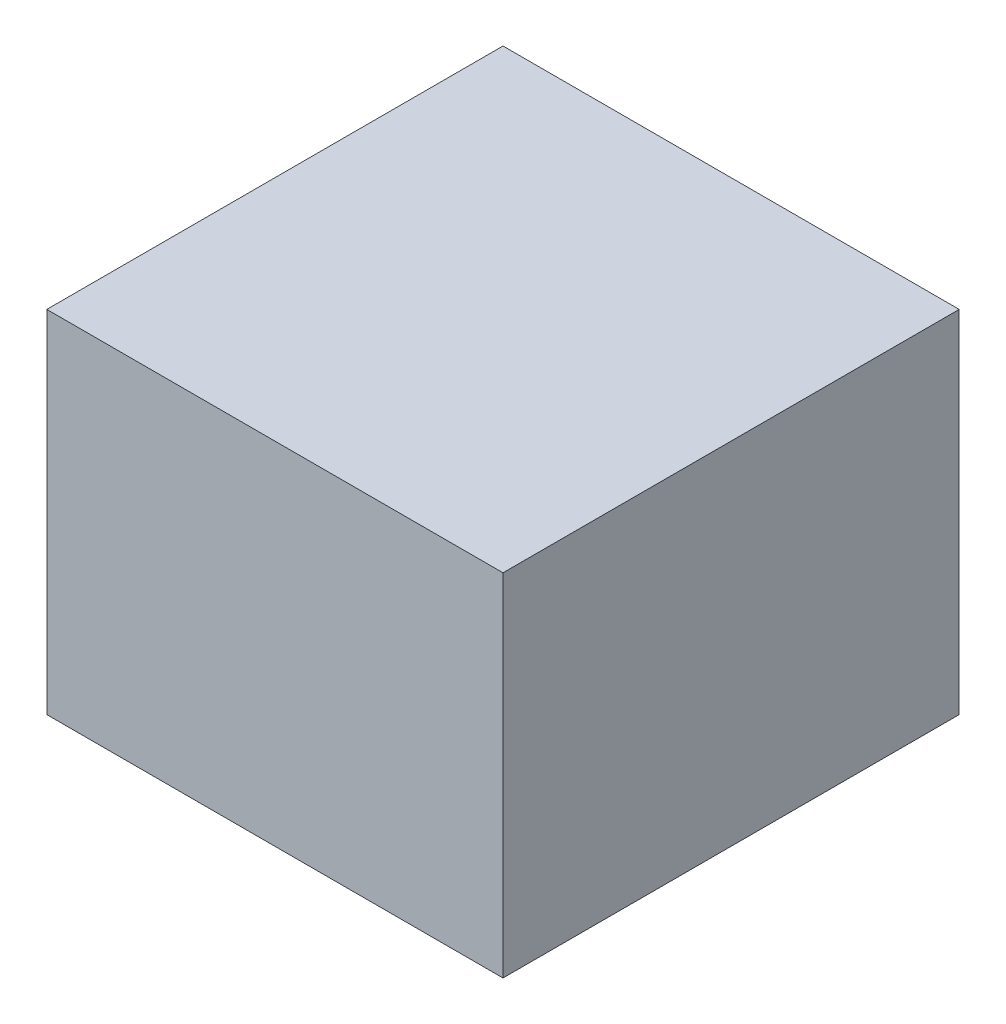
ISO-10303-21;
HEADER;
FILE_DESCRIPTION(('STEP AP214'),'2;1');
FILE_NAME('part.step','',(''),(''),'','','');
FILE_SCHEMA(('AUTOMOTIVE_DESIGN { 1 0 10303 214 1 1 1 1 }'));
ENDSEC;
DATA;
#1=APPLICATION_CONTEXT('core data for automotive mechanical design processes');
#2=APPLICATION_PROTOCOL_DEFINITION('international standard','automotive_design',2000,#1);
#3=PRODUCT_CONTEXT('',#1,'mechanical');
#4=PRODUCT('Part','Part','',(#3));
#5=PRODUCT_RELATED_PRODUCT_CATEGORY('part','',(#4));
#6=PRODUCT_DEFINITION_FORMATION('','',#4);
#7=PRODUCT_DEFINITION_CONTEXT('part definition',#1,'design');
#8=PRODUCT_DEFINITION('design','',#6,#7);
#9=PRODUCT_DEFINITION_SHAPE('','',#8);
#10=(LENGTH_UNIT() NAMED_UNIT(*) SI_UNIT(.MILLI.,.METRE.));
#11=(NAMED_UNIT(*) PLANE_ANGLE_UNIT() SI_UNIT($,.RADIAN.));
#12=(NAMED_UNIT(*) SI_UNIT($,.STERADIAN.) SOLID_ANGLE_UNIT());
#13=UNCERTAINTY_MEASURE_WITH_UNIT(LENGTH_MEASURE(1.E-05),#10,'distance_accuracy_value','');
#14=(GEOMETRIC_REPRESENTATION_CONTEXT(3) GLOBAL_UNCERTAINTY_ASSIGNED_CONTEXT((#13)) GLOBAL_UNIT_ASSIGNED_CONTEXT((#10,
#11,#12)) REPRESENTATION_CONTEXT('',''));
#15=CARTESIAN_POINT('',(0.,0.,0.));
#16=DIRECTION('',(0.,0.,1.));
#17=DIRECTION('',(1.,0.,0.));
#18=AXIS2_PLACEMENT_3D('',#15,#16,#17);
#19=CARTESIAN_POINT('',(22.5,7.5,-22.5));
#20=DIRECTION('',(-1.,0.,0.));
#21=DIRECTION('',(0.,0.,1.));
#22=AXIS2_PLACEMENT_3D('',#19,#20,#21);
#23=PLANE('',#22);
#24=DIRECTION('',(0.,0.,-1.));
#25=VECTOR('',#24,1.);
#26=CARTESIAN_POINT('',(22.5,0.,-22.5));
#27=LINE('',#26,#25);
#28=CARTESIAN_POINT('',(22.5,0.,22.5));
#29=VERTEX_POINT('',#28);
#30=CARTESIAN_POINT('',(22.5,0.,-22.5));
#31=VERTEX_POINT('',#30);
#32=EDGE_CURVE('E141',#29,#31,#27,.T.);
#33=ORIENTED_EDGE('',*,*,#32,.T.);
#34=DIRECTION('',(0.,-1.,0.));
#35=VECTOR('',#34,1.);
#36=CARTESIAN_POINT('',(22.5,7.5,-22.5));
#37=LINE('',#36,#35);
#38=CARTESIAN_POINT('',(22.5,7.5,-22.5));
#39=VERTEX_POINT('',#38);
#40=EDGE_CURVE('E11',#39,#31,#37,.T.);
#41=ORIENTED_EDGE('',*,*,#40,.F.);
#42=DIRECTION('',(0.,0.,-1.));
#43=VECTOR('',#42,1.);
#44=CARTESIAN_POINT('',(22.5,7.5,-22.5));
#45=LINE('',#44,#43);
#46=CARTESIAN_POINT('',(22.5,7.5,22.5));
#47=VERTEX_POINT('',#46);
#48=EDGE_CURVE('E152',#47,#39,#45,.T.);
#49=ORIENTED_EDGE('',*,*,#48,.F.);
#50=DIRECTION('',(0.,-1.,0.));
#51=VECTOR('',#50,1.);
#52=CARTESIAN_POINT('',(22.5,7.5,22.5));
#53=LINE('',#52,#51);
#54=EDGE_CURVE('E165',#47,#29,#53,.T.);
#55=ORIENTED_EDGE('',*,*,#54,.T.);
#56=EDGE_LOOP('',(#33,#41,#49,#55));
#57=FACE_BOUND('',#56,.T.);
#58=ADVANCED_FACE('F39',(#57),#23,.F.);
#59=CARTESIAN_POINT('',(-22.5,7.5,-22.5));
#60=DIRECTION('',(0.,0.,1.));
#61=DIRECTION('',(1.,0.,0.));
#62=AXIS2_PLACEMENT_3D('',#59,#60,#61);
#63=PLANE('',#62);
#64=DIRECTION('',(-1.,0.,0.));
#65=VECTOR('',#64,1.);
#66=CARTESIAN_POINT('',(-22.5,0.,-22.5));
#67=LINE('',#66,#65);
#68=CARTESIAN_POINT('',(-22.5,0.,-22.5));
#69=VERTEX_POINT('',#68);
#70=EDGE_CURVE('E146',#31,#69,#67,.T.);
#71=ORIENTED_EDGE('',*,*,#70,.T.);
#72=DIRECTION('',(0.,-1.,0.));
#73=VECTOR('',#72,1.);
#74=CARTESIAN_POINT('',(-22.5,7.5,-22.5));
#75=LINE('',#74,#73);
#76=CARTESIAN_POINT('',(-22.5,7.5,-22.5));
#77=VERTEX_POINT('',#76);
#78=EDGE_CURVE('E48',#77,#69,#75,.T.);
#79=ORIENTED_EDGE('',*,*,#78,.F.);
#80=DIRECTION('',(-1.,0.,0.));
#81=VECTOR('',#80,1.);
#82=CARTESIAN_POINT('',(-22.5,7.5,-22.5));
#83=LINE('',#82,#81);
#84=EDGE_CURVE('E82',#39,#77,#83,.T.);
#85=ORIENTED_EDGE('',*,*,#84,.F.);
#86=ORIENTED_EDGE('',*,*,#40,.T.);
#87=EDGE_LOOP('',(#71,#79,#85,#86));
#88=FACE_BOUND('',#87,.T.);
#89=ADVANCED_FACE('F197',(#88),#63,.F.);
#90=CARTESIAN_POINT('',(-22.5,7.5,-22.5));
#91=DIRECTION('',(1.,0.,0.));
#92=DIRECTION('',(0.,0.,-1.));
#93=AXIS2_PLACEMENT_3D('',#90,#91,#92);
#94=PLANE('',#93);
#95=DIRECTION('',(0.,0.,1.));
#96=VECTOR('',#95,1.);
#97=CARTESIAN_POINT('',(-22.5,0.,-22.5));
#98=LINE('',#97,#96);
#99=CARTESIAN_POINT('',(-22.5,0.,22.5));
#100=VERTEX_POINT('',#99);
#101=EDGE_CURVE('E72',#69,#100,#98,.T.);
#102=ORIENTED_EDGE('',*,*,#101,.T.);
#103=DIRECTION('',(0.,-1.,0.));
#104=VECTOR('',#103,1.);
#105=CARTESIAN_POINT('',(-22.5,7.5,22.5));
#106=LINE('',#105,#104);
#107=CARTESIAN_POINT('',(-22.5,7.5,22.5));
#108=VERTEX_POINT('',#107);
#109=EDGE_CURVE('E56',#108,#100,#106,.T.);
#110=ORIENTED_EDGE('',*,*,#109,.F.);
#111=DIRECTION('',(0.,0.,1.));
#112=VECTOR('',#111,1.);
#113=CARTESIAN_POINT('',(-22.5,7.5,-22.5));
#114=LINE('',#113,#112);
#115=EDGE_CURVE('E158',#77,#108,#114,.T.);
#116=ORIENTED_EDGE('',*,*,#115,.F.);
#117=ORIENTED_EDGE('',*,*,#78,.T.);
#118=EDGE_LOOP('',(#102,#110,#116,#117));
#119=FACE_BOUND('',#118,.T.);
#120=ADVANCED_FACE('F177',(#119),#94,.F.);
#121=CARTESIAN_POINT('',(-22.5,7.5,22.5));
#122=DIRECTION('',(0.,0.,-1.));
#123=DIRECTION('',(-1.,0.,0.));
#124=AXIS2_PLACEMENT_3D('',#121,#122,#123);
#125=PLANE('',#124);
#126=DIRECTION('',(1.,0.,0.));
#127=VECTOR('',#126,1.);
#128=CARTESIAN_POINT('',(-22.5,0.,22.5));
#129=LINE('',#128,#127);
#130=EDGE_CURVE('E77',#100,#29,#129,.T.);
#131=ORIENTED_EDGE('',*,*,#130,.T.);
#132=ORIENTED_EDGE('',*,*,#54,.F.);
#133=DIRECTION('',(1.,0.,0.));
#134=VECTOR('',#133,1.);
#135=CARTESIAN_POINT('',(-22.5,7.5,22.5));
#136=LINE('',#135,#134);
#137=EDGE_CURVE('E162',#108,#47,#136,.T.);
#138=ORIENTED_EDGE('',*,*,#137,.F.);
#139=ORIENTED_EDGE('',*,*,#109,.T.);
#140=EDGE_LOOP('',(#131,#132,#138,#139));
#141=FACE_BOUND('',#140,.T.);
#142=ADVANCED_FACE('F182',(#141),#125,.F.);
#143=CARTESIAN_POINT('',(0.,0.,0.));
#144=DIRECTION('',(0.,1.,0.));
#145=DIRECTION('',(0.,0.,1.));
#146=AXIS2_PLACEMENT_3D('',#143,#144,#145);
#147=PLANE('',#146);
#148=ORIENTED_EDGE('',*,*,#32,.F.);
#149=ORIENTED_EDGE('',*,*,#130,.F.);
#150=ORIENTED_EDGE('',*,*,#101,.F.);
#151=ORIENTED_EDGE('',*,*,#70,.F.);
#152=EDGE_LOOP('',(#148,#149,#150,#151));
#153=FACE_BOUND('',#152,.T.);
#154=ADVANCED_FACE('F180',(#153),#147,.F.);
#155=CARTESIAN_POINT('',(0.,7.5,0.));
#156=DIRECTION('',(0.,1.,0.));
#157=DIRECTION('',(0.,0.,1.));
#158=AXIS2_PLACEMENT_3D('',#155,#156,#157);
#159=PLANE('',#158);
#160=DIRECTION('',(0.,0.,-1.));
#161=VECTOR('',#160,1.);
#162=CARTESIAN_POINT('',(32.5,7.5,-32.5));
#163=LINE('',#162,#161);
#164=CARTESIAN_POINT('',(32.5,7.5,32.5));
#165=VERTEX_POINT('',#164);
#166=CARTESIAN_POINT('',(32.5,7.5,-32.5));
#167=VERTEX_POINT('',#166);
#168=EDGE_CURVE('E139',#165,#167,#163,.T.);
#169=ORIENTED_EDGE('',*,*,#168,.F.);
#170=DIRECTION('',(1.,0.,0.));
#171=VECTOR('',#170,1.);
#172=CARTESIAN_POINT('',(-32.5,7.5,32.5));
#173=LINE('',#172,#171);
#174=CARTESIAN_POINT('',(-32.5,7.5,32.5));
#175=VERTEX_POINT('',#174);
#176=EDGE_CURVE('E135',#175,#165,#173,.T.);
#177=ORIENTED_EDGE('',*,*,#176,.F.);
#178=DIRECTION('',(0.,0.,1.));
#179=VECTOR('',#178,1.);
#180=CARTESIAN_POINT('',(-32.5,7.5,-32.5));
#181=LINE('',#180,#179);
#182=CARTESIAN_POINT('',(-32.5,7.5,-32.5));
#183=VERTEX_POINT('',#182);
#184=EDGE_CURVE('E225',#183,#175,#181,.T.);
#185=ORIENTED_EDGE('',*,*,#184,.F.);
#186=DIRECTION('',(-1.,0.,0.));
#187=VECTOR('',#186,1.);
#188=CARTESIAN_POINT('',(-32.5,7.5,-32.5));
#189=LINE('',#188,#187);
#190=EDGE_CURVE('E229',#167,#183,#189,.T.);
#191=ORIENTED_EDGE('',*,*,#190,.F.);
#192=EDGE_LOOP('',(#169,#177,#185,#191));
#193=FACE_BOUND('',#192,.T.);
#194=ORIENTED_EDGE('',*,*,#137,.T.);
#195=ORIENTED_EDGE('',*,*,#48,.T.);
#196=ORIENTED_EDGE('',*,*,#84,.T.);
#197=ORIENTED_EDGE('',*,*,#115,.T.);
#198=EDGE_LOOP('',(#194,#195,#196,#197));
#199=FACE_BOUND('',#198,.T.);
#200=ADVANCED_FACE('F184',(#193,#199),#159,.F.);
#201=CARTESIAN_POINT('',(32.5,57.5,-32.5));
#202=DIRECTION('',(-1.,0.,0.));
#203=DIRECTION('',(0.,0.,1.));
#204=AXIS2_PLACEMENT_3D('',#201,#202,#203);
#205=PLANE('',#204);
#206=ORIENTED_EDGE('',*,*,#168,.T.);
#207=DIRECTION('',(0.,-1.,0.));
#208=VECTOR('',#207,1.);
#209=CARTESIAN_POINT('',(32.5,57.5,-32.5));
#210=LINE('',#209,#208);
#211=CARTESIAN_POINT('',(32.5,57.5,-32.5));
#212=VERTEX_POINT('',#211);
#213=EDGE_CURVE('E117',#212,#167,#210,.T.);
#214=ORIENTED_EDGE('',*,*,#213,.F.);
#215=DIRECTION('',(0.,0.,-1.));
#216=VECTOR('',#215,1.);
#217=CARTESIAN_POINT('',(32.5,57.5,-32.5));
#218=LINE('',#217,#216);
#219=CARTESIAN_POINT('',(32.5,57.5,32.5));
#220=VERTEX_POINT('',#219);
#221=EDGE_CURVE('E125',#220,#212,#218,.T.);
#222=ORIENTED_EDGE('',*,*,#221,.F.);
#223=DIRECTION('',(0.,-1.,0.));
#224=VECTOR('',#223,1.);
#225=CARTESIAN_POINT('',(32.5,57.5,32.5));
#226=LINE('',#225,#224);
#227=EDGE_CURVE('E221',#220,#165,#226,.T.);
#228=ORIENTED_EDGE('',*,*,#227,.T.);
#229=EDGE_LOOP('',(#206,#214,#222,#228));
#230=FACE_BOUND('',#229,.T.);
#231=ADVANCED_FACE('F137',(#230),#205,.F.);
#232=CARTESIAN_POINT('',(-32.5,57.5,-32.5));
#233=DIRECTION('',(0.,0.,1.));
#234=DIRECTION('',(1.,0.,0.));
#235=AXIS2_PLACEMENT_3D('',#232,#233,#234);
#236=PLANE('',#235);
#237=ORIENTED_EDGE('',*,*,#190,.T.);
#238=DIRECTION('',(0.,-1.,0.));
#239=VECTOR('',#238,1.);
#240=CARTESIAN_POINT('',(-32.5,57.5,-32.5));
#241=LINE('',#240,#239);
#242=CARTESIAN_POINT('',(-32.5,57.5,-32.5));
#243=VERTEX_POINT('',#242);
#244=EDGE_CURVE('E120',#243,#183,#241,.T.);
#245=ORIENTED_EDGE('',*,*,#244,.F.);
#246=DIRECTION('',(-1.,0.,0.));
#247=VECTOR('',#246,1.);
#248=CARTESIAN_POINT('',(-32.5,57.5,-32.5));
#249=LINE('',#248,#247);
#250=EDGE_CURVE('E113',#212,#243,#249,.T.);
#251=ORIENTED_EDGE('',*,*,#250,.F.);
#252=ORIENTED_EDGE('',*,*,#213,.T.);
#253=EDGE_LOOP('',(#237,#245,#251,#252));
#254=FACE_BOUND('',#253,.T.);
#255=ADVANCED_FACE('F115',(#254),#236,.F.);
#256=CARTESIAN_POINT('',(-32.5,57.5,-32.5));
#257=DIRECTION('',(1.,0.,0.));
#258=DIRECTION('',(0.,0.,-1.));
#259=AXIS2_PLACEMENT_3D('',#256,#257,#258);
#260=PLANE('',#259);
#261=ORIENTED_EDGE('',*,*,#184,.T.);
#262=DIRECTION('',(0.,-1.,0.));
#263=VECTOR('',#262,1.);
#264=CARTESIAN_POINT('',(-32.5,57.5,32.5));
#265=LINE('',#264,#263);
#266=CARTESIAN_POINT('',(-32.5,57.5,32.5));
#267=VERTEX_POINT('',#266);
#268=EDGE_CURVE('E148',#267,#175,#265,.T.);
#269=ORIENTED_EDGE('',*,*,#268,.F.);
#270=DIRECTION('',(0.,0.,1.));
#271=VECTOR('',#270,1.);
#272=CARTESIAN_POINT('',(-32.5,57.5,-32.5));
#273=LINE('',#272,#271);
#274=EDGE_CURVE('E124',#243,#267,#273,.T.);
#275=ORIENTED_EDGE('',*,*,#274,.F.);
#276=ORIENTED_EDGE('',*,*,#244,.T.);
#277=EDGE_LOOP('',(#261,#269,#275,#276));
#278=FACE_BOUND('',#277,.T.);
#279=ADVANCED_FACE('F210',(#278),#260,.F.);
#280=CARTESIAN_POINT('',(-32.5,57.5,32.5));
#281=DIRECTION('',(0.,0.,-1.));
#282=DIRECTION('',(-1.,0.,0.));
#283=AXIS2_PLACEMENT_3D('',#280,#281,#282);
#284=PLANE('',#283);
#285=ORIENTED_EDGE('',*,*,#176,.T.);
#286=ORIENTED_EDGE('',*,*,#227,.F.);
#287=DIRECTION('',(1.,0.,0.));
#288=VECTOR('',#287,1.);
#289=CARTESIAN_POINT('',(-32.5,57.5,32.5));
#290=LINE('',#289,#288);
#291=EDGE_CURVE('E130',#267,#220,#290,.T.);
#292=ORIENTED_EDGE('',*,*,#291,.F.);
#293=ORIENTED_EDGE('',*,*,#268,.T.);
#294=EDGE_LOOP('',(#285,#286,#292,#293));
#295=FACE_BOUND('',#294,.T.);
#296=ADVANCED_FACE('F212',(#295),#284,.F.);
#297=CARTESIAN_POINT('',(0.,57.5,0.));
#298=DIRECTION('',(0.,1.,0.));
#299=DIRECTION('',(0.,0.,1.));
#300=AXIS2_PLACEMENT_3D('',#297,#298,#299);
#301=PLANE('',#300);
#302=ORIENTED_EDGE('',*,*,#221,.T.);
#303=ORIENTED_EDGE('',*,*,#250,.T.);
#304=ORIENTED_EDGE('',*,*,#274,.T.);
#305=ORIENTED_EDGE('',*,*,#291,.T.);
#306=EDGE_LOOP('',(#302,#303,#304,#305));
#307=FACE_BOUND('',#306,.T.);
#308=ADVANCED_FACE('F128',(#307),#301,.T.);
#309=CLOSED_SHELL('',(#58,#89,#120,#142,#154,#200,#231,#255,#279,#296,#308));
#310=MANIFOLD_SOLID_BREP('B2',#309);
#311=ADVANCED_BREP_SHAPE_REPRESENTATION('',(#18,#310),#14);
#312=SHAPE_DEFINITION_REPRESENTATION(#9,#311);
ENDSEC;
END-ISO-10303-21;
